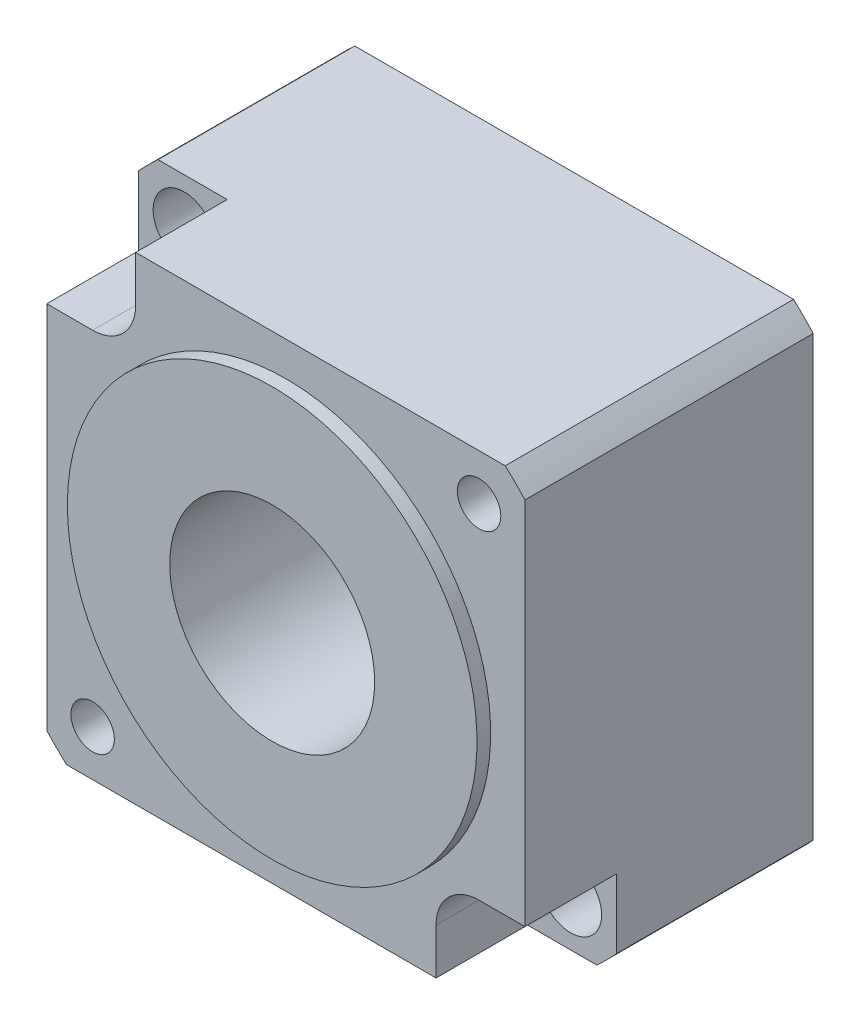
ISO-10303-21;
HEADER;
FILE_DESCRIPTION(('STEP AP214'),'2;1');
FILE_NAME('part.step','',(''),(''),'','','');
FILE_SCHEMA(('AUTOMOTIVE_DESIGN { 1 0 10303 214 1 1 1 1 }'));
ENDSEC;
DATA;
#1=APPLICATION_CONTEXT('core data for automotive mechanical design processes');
#2=APPLICATION_PROTOCOL_DEFINITION('international standard','automotive_design',2000,#1);
#3=PRODUCT_CONTEXT('',#1,'mechanical');
#4=PRODUCT('Part','Part','',(#3));
#5=PRODUCT_RELATED_PRODUCT_CATEGORY('part','',(#4));
#6=PRODUCT_DEFINITION_FORMATION('','',#4);
#7=PRODUCT_DEFINITION_CONTEXT('part definition',#1,'design');
#8=PRODUCT_DEFINITION('design','',#6,#7);
#9=PRODUCT_DEFINITION_SHAPE('','',#8);
#10=(LENGTH_UNIT() NAMED_UNIT(*) SI_UNIT(.MILLI.,.METRE.));
#11=(NAMED_UNIT(*) PLANE_ANGLE_UNIT() SI_UNIT($,.RADIAN.));
#12=(NAMED_UNIT(*) SI_UNIT($,.STERADIAN.) SOLID_ANGLE_UNIT());
#13=UNCERTAINTY_MEASURE_WITH_UNIT(LENGTH_MEASURE(1.E-05),#10,'distance_accuracy_value','');
#14=(GEOMETRIC_REPRESENTATION_CONTEXT(3) GLOBAL_UNCERTAINTY_ASSIGNED_CONTEXT((#13)) GLOBAL_UNIT_ASSIGNED_CONTEXT((#10,
#11,#12)) REPRESENTATION_CONTEXT('',''));
#15=CARTESIAN_POINT('',(0.,0.,0.));
#16=DIRECTION('',(0.,0.,1.));
#17=DIRECTION('',(1.,0.,0.));
#18=AXIS2_PLACEMENT_3D('',#15,#16,#17);
#19=CARTESIAN_POINT('',(17.9605122421383,17.9605122421383,-9.90600000000086));
#20=DIRECTION('',(0.,0.,1.));
#21=DIRECTION('',(1.,0.,0.));
#22=AXIS2_PLACEMENT_3D('',#19,#20,#21);
#23=CONICAL_SURFACE('',#22,2.01929999998881,1.02974425867198);
#24=CARTESIAN_POINT('',(17.9605122421383,17.9605122421383,-11.1193178479994));
#25=VERTEX_POINT('',#24);
#26=VERTEX_LOOP('',#25);
#27=FACE_BOUND('',#26,.T.);
#28=CARTESIAN_POINT('',(17.9605122421383,17.9605122421383,-9.906));
#29=DIRECTION('',(0.,0.,1.));
#30=DIRECTION('',(1.,0.,0.));
#31=AXIS2_PLACEMENT_3D('',#28,#29,#30);
#32=CIRCLE('',#31,2.0193);
#33=CARTESIAN_POINT('',(19.9798122421383,17.9605122421383,-9.906));
#34=VERTEX_POINT('',#33);
#35=EDGE_CURVE('E221',#34,#34,#32,.T.);
#36=ORIENTED_EDGE('',*,*,#35,.T.);
#37=EDGE_LOOP('',(#36));
#38=FACE_BOUND('',#37,.T.);
#39=ADVANCED_FACE('F17',(#27,#38),#23,.F.);
#40=CARTESIAN_POINT('',(-17.9605122421383,-17.9605122421383,-9.90600000000086));
#41=DIRECTION('',(0.,0.,1.));
#42=DIRECTION('',(1.,0.,0.));
#43=AXIS2_PLACEMENT_3D('',#40,#41,#42);
#44=CONICAL_SURFACE('',#43,2.01929999995557,1.02974425866471);
#45=CARTESIAN_POINT('',(-17.9605122421383,-17.9605122421383,-11.1193178479994));
#46=VERTEX_POINT('',#45);
#47=VERTEX_LOOP('',#46);
#48=FACE_BOUND('',#47,.T.);
#49=CARTESIAN_POINT('',(-17.9605122421383,-17.9605122421383,-9.906));
#50=DIRECTION('',(0.,0.,1.));
#51=DIRECTION('',(1.,0.,0.));
#52=AXIS2_PLACEMENT_3D('',#49,#50,#51);
#53=CIRCLE('',#52,2.0193);
#54=CARTESIAN_POINT('',(-15.9412122421383,-17.9605122421383,-9.906));
#55=VERTEX_POINT('',#54);
#56=EDGE_CURVE('E218',#55,#55,#53,.T.);
#57=ORIENTED_EDGE('',*,*,#56,.T.);
#58=EDGE_LOOP('',(#57));
#59=FACE_BOUND('',#58,.T.);
#60=ADVANCED_FACE('F439',(#48,#59),#44,.F.);
#61=CARTESIAN_POINT('',(17.9605122421383,17.9605122421383,0.));
#62=DIRECTION('',(0.,0.,1.));
#63=DIRECTION('',(1.,0.,0.));
#64=AXIS2_PLACEMENT_3D('',#61,#62,#63);
#65=CYLINDRICAL_SURFACE('',#64,2.0193);
#66=ORIENTED_EDGE('',*,*,#35,.F.);
#67=EDGE_LOOP('',(#66));
#68=FACE_BOUND('',#67,.T.);
#69=CARTESIAN_POINT('',(17.9605122421383,17.9605122421383,0.));
#70=DIRECTION('',(0.,0.,1.));
#71=DIRECTION('',(1.,0.,0.));
#72=AXIS2_PLACEMENT_3D('',#69,#70,#71);
#73=CIRCLE('',#72,2.0193);
#74=CARTESIAN_POINT('',(19.9798122421383,17.9605122421383,0.));
#75=VERTEX_POINT('',#74);
#76=EDGE_CURVE('E20',#75,#75,#73,.T.);
#77=ORIENTED_EDGE('',*,*,#76,.T.);
#78=EDGE_LOOP('',(#77));
#79=FACE_BOUND('',#78,.T.);
#80=ADVANCED_FACE('F282',(#68,#79),#65,.F.);
#81=CARTESIAN_POINT('',(-17.9605122421383,-17.9605122421383,0.));
#82=DIRECTION('',(0.,0.,1.));
#83=DIRECTION('',(1.,0.,0.));
#84=AXIS2_PLACEMENT_3D('',#81,#82,#83);
#85=CYLINDRICAL_SURFACE('',#84,2.0193);
#86=ORIENTED_EDGE('',*,*,#56,.F.);
#87=EDGE_LOOP('',(#86));
#88=FACE_BOUND('',#87,.T.);
#89=CARTESIAN_POINT('',(-17.9605122421383,-17.9605122421383,0.));
#90=DIRECTION('',(0.,0.,1.));
#91=DIRECTION('',(1.,0.,0.));
#92=AXIS2_PLACEMENT_3D('',#89,#90,#91);
#93=CIRCLE('',#92,2.0193);
#94=CARTESIAN_POINT('',(-15.9412122421383,-17.9605122421383,0.));
#95=VERTEX_POINT('',#94);
#96=EDGE_CURVE('E275',#95,#95,#93,.T.);
#97=ORIENTED_EDGE('',*,*,#96,.T.);
#98=EDGE_LOOP('',(#97));
#99=FACE_BOUND('',#98,.T.);
#100=ADVANCED_FACE('F433',(#88,#99),#85,.F.);
#101=CARTESIAN_POINT('',(0.,0.,1.27));
#102=DIRECTION('',(0.,0.,-1.));
#103=DIRECTION('',(-1.,0.,0.));
#104=AXIS2_PLACEMENT_3D('',#101,#102,#103);
#105=CYLINDRICAL_SURFACE('',#104,19.0373);
#106=CARTESIAN_POINT('',(0.,0.,0.));
#107=DIRECTION('',(0.,0.,-1.));
#108=DIRECTION('',(-1.,0.,0.));
#109=AXIS2_PLACEMENT_3D('',#106,#107,#108);
#110=CIRCLE('',#109,19.0373);
#111=CARTESIAN_POINT('',(-19.0373,0.,0.));
#112=VERTEX_POINT('',#111);
#113=EDGE_CURVE('E185',#112,#112,#110,.F.);
#114=ORIENTED_EDGE('',*,*,#113,.T.);
#115=EDGE_LOOP('',(#114));
#116=FACE_BOUND('',#115,.T.);
#117=CARTESIAN_POINT('',(0.,0.,1.27));
#118=DIRECTION('',(0.,0.,-1.));
#119=DIRECTION('',(-1.,0.,0.));
#120=AXIS2_PLACEMENT_3D('',#117,#118,#119);
#121=CIRCLE('',#120,19.0373);
#122=CARTESIAN_POINT('',(-19.0373,0.,1.27));
#123=VERTEX_POINT('',#122);
#124=EDGE_CURVE('E172',#123,#123,#121,.F.);
#125=ORIENTED_EDGE('',*,*,#124,.F.);
#126=EDGE_LOOP('',(#125));
#127=FACE_BOUND('',#126,.T.);
#128=ADVANCED_FACE('F427',(#116,#127),#105,.T.);
#129=CARTESIAN_POINT('',(-17.9605122421383,17.9605122421383,-8.509));
#130=DIRECTION('',(0.,0.,1.));
#131=DIRECTION('',(1.,0.,0.));
#132=AXIS2_PLACEMENT_3D('',#129,#130,#131);
#133=CYLINDRICAL_SURFACE('',#132,4.0005);
#134=DIRECTION('',(0.,0.,-1.));
#135=VECTOR('',#134,1.);
#136=CARTESIAN_POINT('',(-13.9600122421383,17.9605122421383,-8.509));
#137=LINE('',#136,#135);
#138=CARTESIAN_POINT('',(-13.9600122421383,17.9605122421383,0.));
#139=VERTEX_POINT('',#138);
#140=CARTESIAN_POINT('',(-13.9600122421383,17.9605122421383,-8.509));
#141=VERTEX_POINT('',#140);
#142=EDGE_CURVE('E215',#139,#141,#137,.T.);
#143=ORIENTED_EDGE('',*,*,#142,.T.);
#144=CARTESIAN_POINT('',(-17.9605122421383,17.9605122421383,-8.509));
#145=DIRECTION('',(0.,0.,1.));
#146=DIRECTION('',(1.,0.,0.));
#147=AXIS2_PLACEMENT_3D('',#144,#145,#146);
#148=CIRCLE('',#147,4.0005);
#149=CARTESIAN_POINT('',(-17.9605122421383,13.9600122421383,-8.509));
#150=VERTEX_POINT('',#149);
#151=EDGE_CURVE('E266',#150,#141,#148,.T.);
#152=ORIENTED_EDGE('',*,*,#151,.F.);
#153=DIRECTION('',(0.,0.,1.));
#154=VECTOR('',#153,1.);
#155=CARTESIAN_POINT('',(-17.9605122421383,13.9600122421383,-8.509));
#156=LINE('',#155,#154);
#157=CARTESIAN_POINT('',(-17.9605122421383,13.9600122421383,0.));
#158=VERTEX_POINT('',#157);
#159=EDGE_CURVE('E114',#150,#158,#156,.T.);
#160=ORIENTED_EDGE('',*,*,#159,.T.);
#161=CARTESIAN_POINT('',(-17.9605122421383,17.9605122421383,0.));
#162=DIRECTION('',(0.,0.,1.));
#163=DIRECTION('',(1.,0.,0.));
#164=AXIS2_PLACEMENT_3D('',#161,#162,#163);
#165=CIRCLE('',#164,4.0005);
#166=EDGE_CURVE('E182',#158,#139,#165,.T.);
#167=ORIENTED_EDGE('',*,*,#166,.T.);
#168=EDGE_LOOP('',(#143,#152,#160,#167));
#169=FACE_BOUND('',#168,.T.);
#170=ADVANCED_FACE('F404',(#169),#133,.F.);
#171=CARTESIAN_POINT('',(17.9605122421383,-17.9605122421383,-8.509));
#172=DIRECTION('',(0.,0.,1.));
#173=DIRECTION('',(1.,0.,0.));
#174=AXIS2_PLACEMENT_3D('',#171,#172,#173);
#175=CYLINDRICAL_SURFACE('',#174,4.0005);
#176=DIRECTION('',(0.,0.,1.));
#177=VECTOR('',#176,1.);
#178=CARTESIAN_POINT('',(13.9600122421383,-17.9605122421383,-8.509));
#179=LINE('',#178,#177);
#180=CARTESIAN_POINT('',(13.9600122421383,-17.9605122421383,0.));
#181=VERTEX_POINT('',#180);
#182=CARTESIAN_POINT('',(13.9600122421383,-17.9605122421383,-8.509));
#183=VERTEX_POINT('',#182);
#184=EDGE_CURVE('E173',#181,#183,#179,.F.);
#185=ORIENTED_EDGE('',*,*,#184,.T.);
#186=CARTESIAN_POINT('',(17.9605122421383,-17.9605122421383,-8.509));
#187=DIRECTION('',(0.,0.,1.));
#188=DIRECTION('',(1.,0.,0.));
#189=AXIS2_PLACEMENT_3D('',#186,#187,#188);
#190=CIRCLE('',#189,4.0005);
#191=CARTESIAN_POINT('',(17.9605122421383,-13.9600122421383,-8.509));
#192=VERTEX_POINT('',#191);
#193=EDGE_CURVE('E160',#192,#183,#190,.T.);
#194=ORIENTED_EDGE('',*,*,#193,.F.);
#195=DIRECTION('',(0.,0.,1.));
#196=VECTOR('',#195,1.);
#197=CARTESIAN_POINT('',(17.9605122421383,-13.9600122421383,-8.509));
#198=LINE('',#197,#196);
#199=CARTESIAN_POINT('',(17.9605122421383,-13.9600122421383,0.));
#200=VERTEX_POINT('',#199);
#201=EDGE_CURVE('E213',#192,#200,#198,.T.);
#202=ORIENTED_EDGE('',*,*,#201,.T.);
#203=CARTESIAN_POINT('',(17.9605122421383,-17.9605122421383,0.));
#204=DIRECTION('',(0.,0.,1.));
#205=DIRECTION('',(1.,0.,0.));
#206=AXIS2_PLACEMENT_3D('',#203,#204,#205);
#207=CIRCLE('',#206,4.0005);
#208=EDGE_CURVE('E179',#200,#181,#207,.T.);
#209=ORIENTED_EDGE('',*,*,#208,.T.);
#210=EDGE_LOOP('',(#185,#194,#202,#209));
#211=FACE_BOUND('',#210,.T.);
#212=ADVANCED_FACE('F417',(#211),#175,.F.);
#213=CARTESIAN_POINT('',(-17.9605122421383,13.9600122421383,-8.509));
#214=DIRECTION('',(0.,-1.,0.));
#215=DIRECTION('',(1.,0.,0.));
#216=AXIS2_PLACEMENT_3D('',#213,#214,#215);
#217=PLANE('',#216);
#218=ORIENTED_EDGE('',*,*,#159,.F.);
#219=DIRECTION('',(1.,0.,0.));
#220=VECTOR('',#219,1.);
#221=CARTESIAN_POINT('',(-17.9605122421383,13.9600122421383,-8.509));
#222=LINE('',#221,#220);
#223=CARTESIAN_POINT('',(-22.225,13.9600122421383,-8.509));
#224=VERTEX_POINT('',#223);
#225=EDGE_CURVE('E168',#224,#150,#222,.T.);
#226=ORIENTED_EDGE('',*,*,#225,.F.);
#227=DIRECTION('',(0.,0.,-1.));
#228=VECTOR('',#227,1.);
#229=CARTESIAN_POINT('',(-22.225,13.9600122421383,-28.067));
#230=LINE('',#229,#228);
#231=CARTESIAN_POINT('',(-22.225,13.9600122421383,0.));
#232=VERTEX_POINT('',#231);
#233=EDGE_CURVE('E207',#224,#232,#230,.F.);
#234=ORIENTED_EDGE('',*,*,#233,.T.);
#235=DIRECTION('',(-1.,0.,0.));
#236=VECTOR('',#235,1.);
#237=CARTESIAN_POINT('',(0.,13.9600122421383,0.));
#238=LINE('',#237,#236);
#239=EDGE_CURVE('E183',#232,#158,#238,.F.);
#240=ORIENTED_EDGE('',*,*,#239,.T.);
#241=EDGE_LOOP('',(#218,#226,#234,#240));
#242=FACE_BOUND('',#241,.T.);
#243=ADVANCED_FACE('F401',(#242),#217,.F.);
#244=CARTESIAN_POINT('',(-13.9600122421383,17.9605122421383,-8.509));
#245=DIRECTION('',(1.,0.,0.));
#246=DIRECTION('',(0.,0.,-1.));
#247=AXIS2_PLACEMENT_3D('',#244,#245,#246);
#248=PLANE('',#247);
#249=DIRECTION('',(0.,0.,-1.));
#250=VECTOR('',#249,1.);
#251=CARTESIAN_POINT('',(-13.9600122421383,22.225,-28.067));
#252=LINE('',#251,#250);
#253=CARTESIAN_POINT('',(-13.9600122421383,22.225,0.));
#254=VERTEX_POINT('',#253);
#255=CARTESIAN_POINT('',(-13.9600122421383,22.225,-8.509));
#256=VERTEX_POINT('',#255);
#257=EDGE_CURVE('E198',#254,#256,#252,.T.);
#258=ORIENTED_EDGE('',*,*,#257,.T.);
#259=DIRECTION('',(0.,1.,0.));
#260=VECTOR('',#259,1.);
#261=CARTESIAN_POINT('',(-13.9600122421383,17.9605122421383,-8.509));
#262=LINE('',#261,#260);
#263=EDGE_CURVE('E269',#141,#256,#262,.T.);
#264=ORIENTED_EDGE('',*,*,#263,.F.);
#265=ORIENTED_EDGE('',*,*,#142,.F.);
#266=DIRECTION('',(0.,1.,0.));
#267=VECTOR('',#266,1.);
#268=CARTESIAN_POINT('',(-13.9600122421383,0.,0.));
#269=LINE('',#268,#267);
#270=EDGE_CURVE('E180',#139,#254,#269,.T.);
#271=ORIENTED_EDGE('',*,*,#270,.T.);
#272=EDGE_LOOP('',(#258,#264,#265,#271));
#273=FACE_BOUND('',#272,.T.);
#274=ADVANCED_FACE('F296',(#273),#248,.F.);
#275=CARTESIAN_POINT('',(17.9605122421383,-13.9600122421383,-8.509));
#276=DIRECTION('',(0.,1.,0.));
#277=DIRECTION('',(-1.,0.,0.));
#278=AXIS2_PLACEMENT_3D('',#275,#276,#277);
#279=PLANE('',#278);
#280=ORIENTED_EDGE('',*,*,#201,.F.);
#281=DIRECTION('',(1.,0.,0.));
#282=VECTOR('',#281,1.);
#283=CARTESIAN_POINT('',(17.9605122421383,-13.9600122421383,-8.509));
#284=LINE('',#283,#282);
#285=CARTESIAN_POINT('',(22.225,-13.9600122421383,-8.509));
#286=VERTEX_POINT('',#285);
#287=EDGE_CURVE('E265',#286,#192,#284,.F.);
#288=ORIENTED_EDGE('',*,*,#287,.F.);
#289=DIRECTION('',(0.,0.,1.));
#290=VECTOR('',#289,1.);
#291=CARTESIAN_POINT('',(22.225,-13.9600122421383,-28.067));
#292=LINE('',#291,#290);
#293=CARTESIAN_POINT('',(22.225,-13.9600122421383,0.));
#294=VERTEX_POINT('',#293);
#295=EDGE_CURVE('E189',#286,#294,#292,.T.);
#296=ORIENTED_EDGE('',*,*,#295,.T.);
#297=DIRECTION('',(-1.,0.,0.));
#298=VECTOR('',#297,1.);
#299=CARTESIAN_POINT('',(0.,-13.9600122421383,0.));
#300=LINE('',#299,#298);
#301=EDGE_CURVE('E176',#294,#200,#300,.T.);
#302=ORIENTED_EDGE('',*,*,#301,.T.);
#303=EDGE_LOOP('',(#280,#288,#296,#302));
#304=FACE_BOUND('',#303,.T.);
#305=ADVANCED_FACE('F286',(#304),#279,.F.);
#306=CARTESIAN_POINT('',(0.,0.,0.));
#307=DIRECTION('',(0.,0.,-1.));
#308=DIRECTION('',(-1.,0.,0.));
#309=AXIS2_PLACEMENT_3D('',#306,#307,#308);
#310=PLANE('',#309);
#311=ORIENTED_EDGE('',*,*,#301,.F.);
#312=DIRECTION('',(0.,-1.,0.));
#313=VECTOR('',#312,1.);
#314=CARTESIAN_POINT('',(22.225,22.225,0.));
#315=LINE('',#314,#313);
#316=CARTESIAN_POINT('',(22.225,20.3918067186309,0.));
#317=VERTEX_POINT('',#316);
#318=EDGE_CURVE('E191',#294,#317,#315,.F.);
#319=ORIENTED_EDGE('',*,*,#318,.T.);
#320=CARTESIAN_POINT('',(0.,0.,0.));
#321=DIRECTION('',(0.,0.,1.));
#322=DIRECTION('',(1.,0.,0.));
#323=AXIS2_PLACEMENT_3D('',#320,#321,#322);
#324=CIRCLE('',#323,30.1625);
#325=CARTESIAN_POINT('',(20.3918067186309,22.225,0.));
#326=VERTEX_POINT('',#325);
#327=EDGE_CURVE('E190',#326,#317,#324,.F.);
#328=ORIENTED_EDGE('',*,*,#327,.F.);
#329=DIRECTION('',(1.,0.,0.));
#330=VECTOR('',#329,1.);
#331=CARTESIAN_POINT('',(22.225,22.225,0.));
#332=LINE('',#331,#330);
#333=EDGE_CURVE('E195',#326,#254,#332,.F.);
#334=ORIENTED_EDGE('',*,*,#333,.T.);
#335=ORIENTED_EDGE('',*,*,#270,.F.);
#336=ORIENTED_EDGE('',*,*,#166,.F.);
#337=ORIENTED_EDGE('',*,*,#239,.F.);
#338=DIRECTION('',(0.,1.,0.));
#339=VECTOR('',#338,1.);
#340=CARTESIAN_POINT('',(-22.225,22.225,0.));
#341=LINE('',#340,#339);
#342=CARTESIAN_POINT('',(-22.225,-20.3918067186309,0.));
#343=VERTEX_POINT('',#342);
#344=EDGE_CURVE('E208',#232,#343,#341,.F.);
#345=ORIENTED_EDGE('',*,*,#344,.T.);
#346=CARTESIAN_POINT('',(0.,0.,0.));
#347=DIRECTION('',(0.,0.,1.));
#348=DIRECTION('',(1.,0.,0.));
#349=AXIS2_PLACEMENT_3D('',#346,#347,#348);
#350=CIRCLE('',#349,30.1625);
#351=CARTESIAN_POINT('',(-20.3918067186309,-22.225,0.));
#352=VERTEX_POINT('',#351);
#353=EDGE_CURVE('E161',#352,#343,#350,.F.);
#354=ORIENTED_EDGE('',*,*,#353,.F.);
#355=DIRECTION('',(1.,0.,0.));
#356=VECTOR('',#355,1.);
#357=CARTESIAN_POINT('',(22.225,-22.225,0.));
#358=LINE('',#357,#356);
#359=CARTESIAN_POINT('',(13.9600122421383,-22.225,0.));
#360=VERTEX_POINT('',#359);
#361=EDGE_CURVE('E153',#352,#360,#358,.T.);
#362=ORIENTED_EDGE('',*,*,#361,.T.);
#363=DIRECTION('',(0.,1.,0.));
#364=VECTOR('',#363,1.);
#365=CARTESIAN_POINT('',(13.9600122421383,-17.9605122421383,0.));
#366=LINE('',#365,#364);
#367=EDGE_CURVE('E148',#360,#181,#366,.T.);
#368=ORIENTED_EDGE('',*,*,#367,.T.);
#369=ORIENTED_EDGE('',*,*,#208,.F.);
#370=EDGE_LOOP('',(#311,#319,#328,#334,#335,#336,#337,#345,#354,#362,#368,#369));
#371=FACE_BOUND('',#370,.T.);
#372=ORIENTED_EDGE('',*,*,#113,.F.);
#373=EDGE_LOOP('',(#372));
#374=FACE_BOUND('',#373,.T.);
#375=ORIENTED_EDGE('',*,*,#96,.F.);
#376=EDGE_LOOP('',(#375));
#377=FACE_BOUND('',#376,.T.);
#378=ORIENTED_EDGE('',*,*,#76,.F.);
#379=EDGE_LOOP('',(#378));
#380=FACE_BOUND('',#379,.T.);
#381=ADVANCED_FACE('F284',(#371,#374,#377,#380),#310,.F.);
#382=CARTESIAN_POINT('',(13.9600122421383,-17.9605122421383,-8.509));
#383=DIRECTION('',(-1.,0.,0.));
#384=DIRECTION('',(0.,0.,1.));
#385=AXIS2_PLACEMENT_3D('',#382,#383,#384);
#386=PLANE('',#385);
#387=DIRECTION('',(0.,0.,1.));
#388=VECTOR('',#387,1.);
#389=CARTESIAN_POINT('',(13.9600122421383,-22.225,-28.067));
#390=LINE('',#389,#388);
#391=CARTESIAN_POINT('',(13.9600122421383,-22.225,-8.509));
#392=VERTEX_POINT('',#391);
#393=EDGE_CURVE('E141',#360,#392,#390,.F.);
#394=ORIENTED_EDGE('',*,*,#393,.T.);
#395=DIRECTION('',(0.,1.,0.));
#396=VECTOR('',#395,1.);
#397=CARTESIAN_POINT('',(13.9600122421383,-17.9605122421383,-8.509));
#398=LINE('',#397,#396);
#399=EDGE_CURVE('E145',#183,#392,#398,.F.);
#400=ORIENTED_EDGE('',*,*,#399,.F.);
#401=ORIENTED_EDGE('',*,*,#184,.F.);
#402=ORIENTED_EDGE('',*,*,#367,.F.);
#403=EDGE_LOOP('',(#394,#400,#401,#402));
#404=FACE_BOUND('',#403,.T.);
#405=ADVANCED_FACE('F143',(#404),#386,.F.);
#406=CARTESIAN_POINT('',(0.,0.,1.27));
#407=DIRECTION('',(0.,0.,1.));
#408=DIRECTION('',(1.,0.,0.));
#409=AXIS2_PLACEMENT_3D('',#406,#407,#408);
#410=PLANE('',#409);
#411=ORIENTED_EDGE('',*,*,#124,.T.);
#412=EDGE_LOOP('',(#411));
#413=FACE_BOUND('',#412,.T.);
#414=CARTESIAN_POINT('',(0.,0.,1.27));
#415=DIRECTION('',(0.,0.,1.));
#416=DIRECTION('',(1.,0.,0.));
#417=AXIS2_PLACEMENT_3D('',#414,#415,#416);
#418=CIRCLE('',#417,9.525);
#419=CARTESIAN_POINT('',(9.525,0.,1.27));
#420=VERTEX_POINT('',#419);
#421=EDGE_CURVE('E165',#420,#420,#418,.F.);
#422=ORIENTED_EDGE('',*,*,#421,.T.);
#423=EDGE_LOOP('',(#422));
#424=FACE_BOUND('',#423,.T.);
#425=ADVANCED_FACE('F294',(#413,#424),#410,.T.);
#426=CARTESIAN_POINT('',(-17.9605122421383,17.9605122421383,-8.509));
#427=DIRECTION('',(0.,0.,1.));
#428=DIRECTION('',(1.,0.,0.));
#429=AXIS2_PLACEMENT_3D('',#426,#427,#428);
#430=PLANE('',#429);
#431=CARTESIAN_POINT('',(-17.9605122421383,17.9605122421383,-8.509));
#432=DIRECTION('',(0.,0.,1.));
#433=DIRECTION('',(1.,0.,0.));
#434=AXIS2_PLACEMENT_3D('',#431,#432,#433);
#435=CIRCLE('',#434,2.8829);
#436=CARTESIAN_POINT('',(-15.0776122421383,17.9605122421383,-8.509));
#437=VERTEX_POINT('',#436);
#438=EDGE_CURVE('E248',#437,#437,#435,.F.);
#439=ORIENTED_EDGE('',*,*,#438,.T.);
#440=EDGE_LOOP('',(#439));
#441=FACE_BOUND('',#440,.T.);
#442=DIRECTION('',(1.,0.,0.));
#443=VECTOR('',#442,1.);
#444=CARTESIAN_POINT('',(22.225,22.225,-8.509));
#445=LINE('',#444,#443);
#446=CARTESIAN_POINT('',(-20.3918067186309,22.225,-8.509));
#447=VERTEX_POINT('',#446);
#448=EDGE_CURVE('E200',#256,#447,#445,.F.);
#449=ORIENTED_EDGE('',*,*,#448,.T.);
#450=CARTESIAN_POINT('',(0.,0.,-8.509));
#451=DIRECTION('',(0.,0.,1.));
#452=DIRECTION('',(1.,0.,0.));
#453=AXIS2_PLACEMENT_3D('',#450,#451,#452);
#454=CIRCLE('',#453,30.1625);
#455=CARTESIAN_POINT('',(-22.225,20.3918067186309,-8.509));
#456=VERTEX_POINT('',#455);
#457=EDGE_CURVE('E199',#456,#447,#454,.F.);
#458=ORIENTED_EDGE('',*,*,#457,.F.);
#459=DIRECTION('',(0.,1.,0.));
#460=VECTOR('',#459,1.);
#461=CARTESIAN_POINT('',(-22.225,22.225,-8.509));
#462=LINE('',#461,#460);
#463=EDGE_CURVE('E204',#456,#224,#462,.F.);
#464=ORIENTED_EDGE('',*,*,#463,.T.);
#465=ORIENTED_EDGE('',*,*,#225,.T.);
#466=ORIENTED_EDGE('',*,*,#151,.T.);
#467=ORIENTED_EDGE('',*,*,#263,.T.);
#468=EDGE_LOOP('',(#449,#458,#464,#465,#466,#467));
#469=FACE_BOUND('',#468,.T.);
#470=ADVANCED_FACE('F352',(#441,#469),#430,.T.);
#471=CARTESIAN_POINT('',(17.9605122421383,-17.9605122421383,-8.509));
#472=DIRECTION('',(0.,0.,1.));
#473=DIRECTION('',(1.,0.,0.));
#474=AXIS2_PLACEMENT_3D('',#471,#472,#473);
#475=PLANE('',#474);
#476=CARTESIAN_POINT('',(17.9605122421383,-17.9605122421383,-8.509));
#477=DIRECTION('',(0.,0.,1.));
#478=DIRECTION('',(1.,0.,0.));
#479=AXIS2_PLACEMENT_3D('',#476,#477,#478);
#480=CIRCLE('',#479,2.8829);
#481=CARTESIAN_POINT('',(20.8434122421383,-17.9605122421383,-8.509));
#482=VERTEX_POINT('',#481);
#483=EDGE_CURVE('E245',#482,#482,#480,.F.);
#484=ORIENTED_EDGE('',*,*,#483,.T.);
#485=EDGE_LOOP('',(#484));
#486=FACE_BOUND('',#485,.T.);
#487=DIRECTION('',(1.,0.,0.));
#488=VECTOR('',#487,1.);
#489=CARTESIAN_POINT('',(22.225,-22.225,-8.509));
#490=LINE('',#489,#488);
#491=CARTESIAN_POINT('',(20.3918067186309,-22.225,-8.509));
#492=VERTEX_POINT('',#491);
#493=EDGE_CURVE('E152',#392,#492,#490,.T.);
#494=ORIENTED_EDGE('',*,*,#493,.T.);
#495=CARTESIAN_POINT('',(0.,0.,-8.509));
#496=DIRECTION('',(0.,0.,1.));
#497=DIRECTION('',(1.,0.,0.));
#498=AXIS2_PLACEMENT_3D('',#495,#496,#497);
#499=CIRCLE('',#498,30.1625);
#500=CARTESIAN_POINT('',(22.225,-20.3918067186309,-8.509));
#501=VERTEX_POINT('',#500);
#502=EDGE_CURVE('E253',#501,#492,#499,.F.);
#503=ORIENTED_EDGE('',*,*,#502,.F.);
#504=DIRECTION('',(0.,-1.,0.));
#505=VECTOR('',#504,1.);
#506=CARTESIAN_POINT('',(22.225,22.225,-8.509));
#507=LINE('',#506,#505);
#508=EDGE_CURVE('E186',#501,#286,#507,.F.);
#509=ORIENTED_EDGE('',*,*,#508,.T.);
#510=ORIENTED_EDGE('',*,*,#287,.T.);
#511=ORIENTED_EDGE('',*,*,#193,.T.);
#512=ORIENTED_EDGE('',*,*,#399,.T.);
#513=EDGE_LOOP('',(#494,#503,#509,#510,#511,#512));
#514=FACE_BOUND('',#513,.T.);
#515=ADVANCED_FACE('F156',(#486,#514),#475,.T.);
#516=CARTESIAN_POINT('',(0.,0.,-28.067));
#517=DIRECTION('',(0.,0.,1.));
#518=DIRECTION('',(1.,0.,0.));
#519=AXIS2_PLACEMENT_3D('',#516,#517,#518);
#520=CYLINDRICAL_SURFACE('',#519,30.1625);
#521=DIRECTION('',(0.,0.,1.));
#522=VECTOR('',#521,1.);
#523=CARTESIAN_POINT('',(-20.3918067186309,-22.225,-28.067));
#524=LINE('',#523,#522);
#525=CARTESIAN_POINT('',(-20.3918067186309,-22.225,-26.797));
#526=VERTEX_POINT('',#525);
#527=EDGE_CURVE('E175',#526,#352,#524,.T.);
#528=ORIENTED_EDGE('',*,*,#527,.T.);
#529=ORIENTED_EDGE('',*,*,#353,.T.);
#530=DIRECTION('',(0.,0.,-1.));
#531=VECTOR('',#530,1.);
#532=CARTESIAN_POINT('',(-22.225,-20.3918067186309,-28.067));
#533=LINE('',#532,#531);
#534=CARTESIAN_POINT('',(-22.225,-20.3918067186309,-26.797));
#535=VERTEX_POINT('',#534);
#536=EDGE_CURVE('E210',#343,#535,#533,.T.);
#537=ORIENTED_EDGE('',*,*,#536,.T.);
#538=CARTESIAN_POINT('',(0.,0.,-26.797));
#539=DIRECTION('',(0.,0.,1.));
#540=DIRECTION('',(1.,0.,0.));
#541=AXIS2_PLACEMENT_3D('',#538,#539,#540);
#542=CIRCLE('',#541,30.1625);
#543=EDGE_CURVE('E242',#526,#535,#542,.F.);
#544=ORIENTED_EDGE('',*,*,#543,.F.);
#545=EDGE_LOOP('',(#528,#529,#537,#544));
#546=FACE_BOUND('',#545,.T.);
#547=ADVANCED_FACE('F345',(#546),#520,.T.);
#548=CARTESIAN_POINT('',(-22.225,22.225,-28.067));
#549=DIRECTION('',(1.,0.,0.));
#550=DIRECTION('',(0.,0.,-1.));
#551=AXIS2_PLACEMENT_3D('',#548,#549,#550);
#552=PLANE('',#551);
#553=ORIENTED_EDGE('',*,*,#536,.F.);
#554=ORIENTED_EDGE('',*,*,#344,.F.);
#555=ORIENTED_EDGE('',*,*,#233,.F.);
#556=ORIENTED_EDGE('',*,*,#463,.F.);
#557=DIRECTION('',(0.,0.,1.));
#558=VECTOR('',#557,1.);
#559=CARTESIAN_POINT('',(-22.225,20.3918067186309,-28.067));
#560=LINE('',#559,#558);
#561=CARTESIAN_POINT('',(-22.225,20.3918067186309,-26.797));
#562=VERTEX_POINT('',#561);
#563=EDGE_CURVE('E261',#562,#456,#560,.T.);
#564=ORIENTED_EDGE('',*,*,#563,.F.);
#565=DIRECTION('',(0.,1.,0.));
#566=VECTOR('',#565,1.);
#567=CARTESIAN_POINT('',(-22.225,0.,-26.797));
#568=LINE('',#567,#566);
#569=EDGE_CURVE('E241',#535,#562,#568,.T.);
#570=ORIENTED_EDGE('',*,*,#569,.F.);
#571=EDGE_LOOP('',(#553,#554,#555,#556,#564,#570));
#572=FACE_BOUND('',#571,.T.);
#573=ADVANCED_FACE('F341',(#572),#552,.F.);
#574=CARTESIAN_POINT('',(0.,0.,-28.067));
#575=DIRECTION('',(0.,0.,1.));
#576=DIRECTION('',(1.,0.,0.));
#577=AXIS2_PLACEMENT_3D('',#574,#575,#576);
#578=CYLINDRICAL_SURFACE('',#577,30.1625);
#579=ORIENTED_EDGE('',*,*,#563,.T.);
#580=ORIENTED_EDGE('',*,*,#457,.T.);
#581=DIRECTION('',(0.,0.,-1.));
#582=VECTOR('',#581,1.);
#583=CARTESIAN_POINT('',(-20.3918067186309,22.225,-28.067));
#584=LINE('',#583,#582);
#585=CARTESIAN_POINT('',(-20.3918067186309,22.225,-26.797));
#586=VERTEX_POINT('',#585);
#587=EDGE_CURVE('E202',#447,#586,#584,.T.);
#588=ORIENTED_EDGE('',*,*,#587,.T.);
#589=CARTESIAN_POINT('',(0.,0.,-26.797));
#590=DIRECTION('',(0.,0.,1.));
#591=DIRECTION('',(1.,0.,0.));
#592=AXIS2_PLACEMENT_3D('',#589,#590,#591);
#593=CIRCLE('',#592,30.1625);
#594=EDGE_CURVE('E238',#562,#586,#593,.F.);
#595=ORIENTED_EDGE('',*,*,#594,.F.);
#596=EDGE_LOOP('',(#579,#580,#588,#595));
#597=FACE_BOUND('',#596,.T.);
#598=ADVANCED_FACE('F337',(#597),#578,.T.);
#599=CARTESIAN_POINT('',(22.225,22.225,-28.067));
#600=DIRECTION('',(0.,-1.,0.));
#601=DIRECTION('',(0.,0.,-1.));
#602=AXIS2_PLACEMENT_3D('',#599,#600,#601);
#603=PLANE('',#602);
#604=ORIENTED_EDGE('',*,*,#587,.F.);
#605=ORIENTED_EDGE('',*,*,#448,.F.);
#606=ORIENTED_EDGE('',*,*,#257,.F.);
#607=ORIENTED_EDGE('',*,*,#333,.F.);
#608=DIRECTION('',(0.,0.,1.));
#609=VECTOR('',#608,1.);
#610=CARTESIAN_POINT('',(20.3918067186309,22.225,-28.067));
#611=LINE('',#610,#609);
#612=CARTESIAN_POINT('',(20.3918067186309,22.225,-26.797));
#613=VERTEX_POINT('',#612);
#614=EDGE_CURVE('E258',#613,#326,#611,.T.);
#615=ORIENTED_EDGE('',*,*,#614,.F.);
#616=DIRECTION('',(-1.,0.,0.));
#617=VECTOR('',#616,1.);
#618=CARTESIAN_POINT('',(0.,22.225,-26.797));
#619=LINE('',#618,#617);
#620=EDGE_CURVE('E237',#586,#613,#619,.F.);
#621=ORIENTED_EDGE('',*,*,#620,.F.);
#622=EDGE_LOOP('',(#604,#605,#606,#607,#615,#621));
#623=FACE_BOUND('',#622,.T.);
#624=ADVANCED_FACE('F333',(#623),#603,.F.);
#625=CARTESIAN_POINT('',(0.,0.,-28.067));
#626=DIRECTION('',(0.,0.,1.));
#627=DIRECTION('',(1.,0.,0.));
#628=AXIS2_PLACEMENT_3D('',#625,#626,#627);
#629=CYLINDRICAL_SURFACE('',#628,30.1625);
#630=ORIENTED_EDGE('',*,*,#614,.T.);
#631=ORIENTED_EDGE('',*,*,#327,.T.);
#632=DIRECTION('',(0.,0.,1.));
#633=VECTOR('',#632,1.);
#634=CARTESIAN_POINT('',(22.225,20.3918067186309,-28.067));
#635=LINE('',#634,#633);
#636=CARTESIAN_POINT('',(22.225,20.3918067186309,-26.797));
#637=VERTEX_POINT('',#636);
#638=EDGE_CURVE('E193',#317,#637,#635,.F.);
#639=ORIENTED_EDGE('',*,*,#638,.T.);
#640=CARTESIAN_POINT('',(0.,0.,-26.797));
#641=DIRECTION('',(0.,0.,1.));
#642=DIRECTION('',(1.,0.,0.));
#643=AXIS2_PLACEMENT_3D('',#640,#641,#642);
#644=CIRCLE('',#643,30.1625);
#645=EDGE_CURVE('E234',#613,#637,#644,.F.);
#646=ORIENTED_EDGE('',*,*,#645,.F.);
#647=EDGE_LOOP('',(#630,#631,#639,#646));
#648=FACE_BOUND('',#647,.T.);
#649=ADVANCED_FACE('F329',(#648),#629,.T.);
#650=CARTESIAN_POINT('',(22.225,22.225,-28.067));
#651=DIRECTION('',(-1.,0.,0.));
#652=DIRECTION('',(0.,-1.,0.));
#653=AXIS2_PLACEMENT_3D('',#650,#651,#652);
#654=PLANE('',#653);
#655=ORIENTED_EDGE('',*,*,#638,.F.);
#656=ORIENTED_EDGE('',*,*,#318,.F.);
#657=ORIENTED_EDGE('',*,*,#295,.F.);
#658=ORIENTED_EDGE('',*,*,#508,.F.);
#659=DIRECTION('',(0.,0.,1.));
#660=VECTOR('',#659,1.);
#661=CARTESIAN_POINT('',(22.225,-20.3918067186309,-28.067));
#662=LINE('',#661,#660);
#663=CARTESIAN_POINT('',(22.225,-20.3918067186309,-26.797));
#664=VERTEX_POINT('',#663);
#665=EDGE_CURVE('E255',#664,#501,#662,.T.);
#666=ORIENTED_EDGE('',*,*,#665,.F.);
#667=DIRECTION('',(0.,1.,0.));
#668=VECTOR('',#667,1.);
#669=CARTESIAN_POINT('',(22.225,0.,-26.797));
#670=LINE('',#669,#668);
#671=EDGE_CURVE('E233',#637,#664,#670,.F.);
#672=ORIENTED_EDGE('',*,*,#671,.F.);
#673=EDGE_LOOP('',(#655,#656,#657,#658,#666,#672));
#674=FACE_BOUND('',#673,.T.);
#675=ADVANCED_FACE('F326',(#674),#654,.F.);
#676=CARTESIAN_POINT('',(0.,0.,-28.067));
#677=DIRECTION('',(0.,0.,1.));
#678=DIRECTION('',(1.,0.,0.));
#679=AXIS2_PLACEMENT_3D('',#676,#677,#678);
#680=CYLINDRICAL_SURFACE('',#679,30.1625);
#681=ORIENTED_EDGE('',*,*,#665,.T.);
#682=ORIENTED_EDGE('',*,*,#502,.T.);
#683=DIRECTION('',(0.,0.,1.));
#684=VECTOR('',#683,1.);
#685=CARTESIAN_POINT('',(20.3918067186309,-22.225,-28.067));
#686=LINE('',#685,#684);
#687=CARTESIAN_POINT('',(20.3918067186309,-22.225,-26.797));
#688=VERTEX_POINT('',#687);
#689=EDGE_CURVE('E35',#492,#688,#686,.F.);
#690=ORIENTED_EDGE('',*,*,#689,.T.);
#691=CARTESIAN_POINT('',(0.,0.,-26.797));
#692=DIRECTION('',(0.,0.,1.));
#693=DIRECTION('',(1.,0.,0.));
#694=AXIS2_PLACEMENT_3D('',#691,#692,#693);
#695=CIRCLE('',#694,30.1625);
#696=EDGE_CURVE('E230',#664,#688,#695,.F.);
#697=ORIENTED_EDGE('',*,*,#696,.F.);
#698=EDGE_LOOP('',(#681,#682,#690,#697));
#699=FACE_BOUND('',#698,.T.);
#700=ADVANCED_FACE('F323',(#699),#680,.T.);
#701=CARTESIAN_POINT('',(22.225,-22.225,-28.067));
#702=DIRECTION('',(0.,1.,0.));
#703=DIRECTION('',(0.,0.,1.));
#704=AXIS2_PLACEMENT_3D('',#701,#702,#703);
#705=PLANE('',#704);
#706=ORIENTED_EDGE('',*,*,#689,.F.);
#707=ORIENTED_EDGE('',*,*,#493,.F.);
#708=ORIENTED_EDGE('',*,*,#393,.F.);
#709=ORIENTED_EDGE('',*,*,#361,.F.);
#710=ORIENTED_EDGE('',*,*,#527,.F.);
#711=DIRECTION('',(-1.,0.,0.));
#712=VECTOR('',#711,1.);
#713=CARTESIAN_POINT('',(0.,-22.225,-26.797));
#714=LINE('',#713,#712);
#715=EDGE_CURVE('E229',#688,#526,#714,.T.);
#716=ORIENTED_EDGE('',*,*,#715,.F.);
#717=EDGE_LOOP('',(#706,#707,#708,#709,#710,#716));
#718=FACE_BOUND('',#717,.T.);
#719=ADVANCED_FACE('F163',(#718),#705,.F.);
#720=CARTESIAN_POINT('',(0.,0.,-28.067));
#721=DIRECTION('',(0.,0.,1.));
#722=DIRECTION('',(1.,0.,0.));
#723=AXIS2_PLACEMENT_3D('',#720,#721,#722);
#724=CYLINDRICAL_SURFACE('',#723,9.525);
#725=ORIENTED_EDGE('',*,*,#421,.F.);
#726=EDGE_LOOP('',(#725));
#727=FACE_BOUND('',#726,.T.);
#728=CARTESIAN_POINT('',(0.,0.,-26.797));
#729=DIRECTION('',(0.,0.,1.));
#730=DIRECTION('',(1.,0.,0.));
#731=AXIS2_PLACEMENT_3D('',#728,#729,#730);
#732=CIRCLE('',#731,9.525);
#733=CARTESIAN_POINT('',(9.525,0.,-26.797));
#734=VERTEX_POINT('',#733);
#735=EDGE_CURVE('E226',#734,#734,#732,.T.);
#736=ORIENTED_EDGE('',*,*,#735,.F.);
#737=EDGE_LOOP('',(#736));
#738=FACE_BOUND('',#737,.T.);
#739=ADVANCED_FACE('F316',(#727,#738),#724,.F.);
#740=CARTESIAN_POINT('',(-17.9605122421383,17.9605122421383,-28.067));
#741=DIRECTION('',(0.,0.,1.));
#742=DIRECTION('',(1.,0.,0.));
#743=AXIS2_PLACEMENT_3D('',#740,#741,#742);
#744=CYLINDRICAL_SURFACE('',#743,2.8829);
#745=ORIENTED_EDGE('',*,*,#438,.F.);
#746=EDGE_LOOP('',(#745));
#747=FACE_BOUND('',#746,.T.);
#748=CARTESIAN_POINT('',(-17.9605122421383,17.9605122421383,-26.797));
#749=DIRECTION('',(0.,0.,1.));
#750=DIRECTION('',(1.,0.,0.));
#751=AXIS2_PLACEMENT_3D('',#748,#749,#750);
#752=CIRCLE('',#751,2.8829);
#753=CARTESIAN_POINT('',(-15.0776122421383,17.9605122421383,-26.797));
#754=VERTEX_POINT('',#753);
#755=EDGE_CURVE('E26',#754,#754,#752,.T.);
#756=ORIENTED_EDGE('',*,*,#755,.F.);
#757=EDGE_LOOP('',(#756));
#758=FACE_BOUND('',#757,.T.);
#759=ADVANCED_FACE('F309',(#747,#758),#744,.F.);
#760=CARTESIAN_POINT('',(17.9605122421383,-17.9605122421383,-28.067));
#761=DIRECTION('',(0.,0.,1.));
#762=DIRECTION('',(1.,0.,0.));
#763=AXIS2_PLACEMENT_3D('',#760,#761,#762);
#764=CYLINDRICAL_SURFACE('',#763,2.8829);
#765=ORIENTED_EDGE('',*,*,#483,.F.);
#766=EDGE_LOOP('',(#765));
#767=FACE_BOUND('',#766,.T.);
#768=CARTESIAN_POINT('',(17.9605122421383,-17.9605122421383,-26.797));
#769=DIRECTION('',(0.,0.,1.));
#770=DIRECTION('',(1.,0.,0.));
#771=AXIS2_PLACEMENT_3D('',#768,#769,#770);
#772=CIRCLE('',#771,2.8829);
#773=CARTESIAN_POINT('',(20.8434122421383,-17.9605122421383,-26.797));
#774=VERTEX_POINT('',#773);
#775=EDGE_CURVE('E10',#774,#774,#772,.T.);
#776=ORIENTED_EDGE('',*,*,#775,.F.);
#777=EDGE_LOOP('',(#776));
#778=FACE_BOUND('',#777,.T.);
#779=ADVANCED_FACE('F303',(#767,#778),#764,.F.);
#780=CARTESIAN_POINT('',(0.,0.,-26.797));
#781=DIRECTION('',(0.,0.,-1.));
#782=DIRECTION('',(-1.,0.,0.));
#783=AXIS2_PLACEMENT_3D('',#780,#781,#782);
#784=PLANE('',#783);
#785=ORIENTED_EDGE('',*,*,#775,.T.);
#786=EDGE_LOOP('',(#785));
#787=FACE_BOUND('',#786,.T.);
#788=ORIENTED_EDGE('',*,*,#755,.T.);
#789=EDGE_LOOP('',(#788));
#790=FACE_BOUND('',#789,.T.);
#791=ORIENTED_EDGE('',*,*,#735,.T.);
#792=EDGE_LOOP('',(#791));
#793=FACE_BOUND('',#792,.T.);
#794=ORIENTED_EDGE('',*,*,#696,.T.);
#795=ORIENTED_EDGE('',*,*,#715,.T.);
#796=ORIENTED_EDGE('',*,*,#543,.T.);
#797=ORIENTED_EDGE('',*,*,#569,.T.);
#798=ORIENTED_EDGE('',*,*,#594,.T.);
#799=ORIENTED_EDGE('',*,*,#620,.T.);
#800=ORIENTED_EDGE('',*,*,#645,.T.);
#801=ORIENTED_EDGE('',*,*,#671,.T.);
#802=EDGE_LOOP('',(#794,#795,#796,#797,#798,#799,#800,#801));
#803=FACE_BOUND('',#802,.T.);
#804=ADVANCED_FACE('F301',(#787,#790,#793,#803),#784,.T.);
#805=CLOSED_SHELL('',(#39,#60,#80,#100,#128,#170,#212,#243,#274,#305,#381,#405,#425,#470,#515,
#547,#573,#598,#624,#649,#675,#700,#719,#739,#759,#779,#804));
#806=MANIFOLD_SOLID_BREP('B1',#805);
#807=ADVANCED_BREP_SHAPE_REPRESENTATION('',(#18,#806),#14);
#808=SHAPE_DEFINITION_REPRESENTATION(#9,#807);
ENDSEC;
END-ISO-10303-21;
